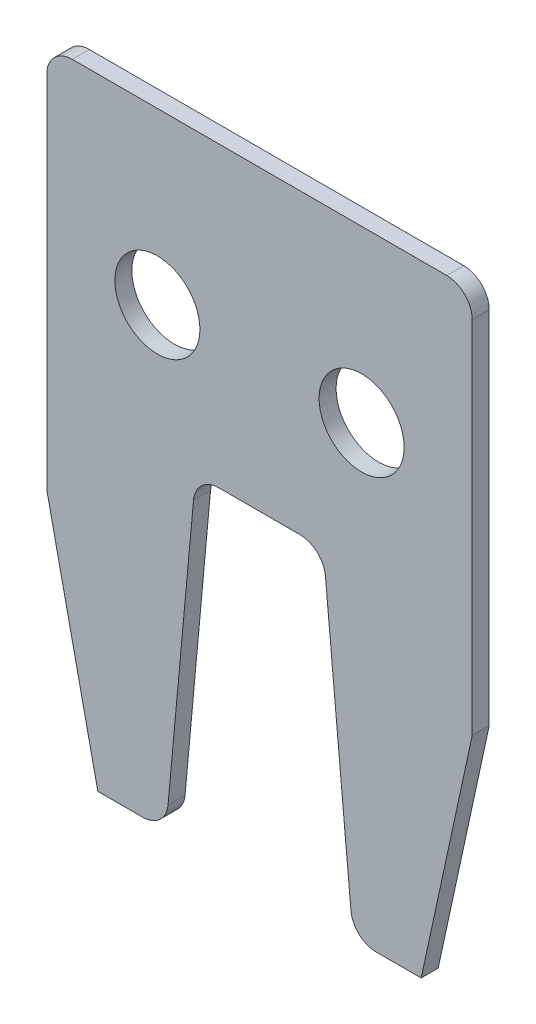
ISO-10303-21;
HEADER;
FILE_DESCRIPTION(('STEP AP214'),'2;1');
FILE_NAME('part.step','',(''),(''),'','','');
FILE_SCHEMA(('AUTOMOTIVE_DESIGN { 1 0 10303 214 1 1 1 1 }'));
ENDSEC;
DATA;
#1=APPLICATION_CONTEXT('core data for automotive mechanical design processes');
#2=APPLICATION_PROTOCOL_DEFINITION('international standard','automotive_design',2000,#1);
#3=PRODUCT_CONTEXT('',#1,'mechanical');
#4=PRODUCT('Part','Part','',(#3));
#5=PRODUCT_RELATED_PRODUCT_CATEGORY('part','',(#4));
#6=PRODUCT_DEFINITION_FORMATION('','',#4);
#7=PRODUCT_DEFINITION_CONTEXT('part definition',#1,'design');
#8=PRODUCT_DEFINITION('design','',#6,#7);
#9=PRODUCT_DEFINITION_SHAPE('','',#8);
#10=(LENGTH_UNIT() NAMED_UNIT(*) SI_UNIT(.MILLI.,.METRE.));
#11=(NAMED_UNIT(*) PLANE_ANGLE_UNIT() SI_UNIT($,.RADIAN.));
#12=(NAMED_UNIT(*) SI_UNIT($,.STERADIAN.) SOLID_ANGLE_UNIT());
#13=UNCERTAINTY_MEASURE_WITH_UNIT(LENGTH_MEASURE(1.E-05),#10,'distance_accuracy_value','');
#14=(GEOMETRIC_REPRESENTATION_CONTEXT(3) GLOBAL_UNCERTAINTY_ASSIGNED_CONTEXT((#13)) GLOBAL_UNIT_ASSIGNED_CONTEXT((#10,
#11,#12)) REPRESENTATION_CONTEXT('',''));
#15=CARTESIAN_POINT('',(0.,0.,0.));
#16=DIRECTION('',(0.,0.,1.));
#17=DIRECTION('',(1.,0.,0.));
#18=AXIS2_PLACEMENT_3D('',#15,#16,#17);
#19=CARTESIAN_POINT('',(-25.,-812.,27.));
#20=DIRECTION('',(0.,1.,0.));
#21=DIRECTION('',(0.,0.,1.));
#22=AXIS2_PLACEMENT_3D('',#19,#20,#21);
#23=PLANE('',#22);
#24=DIRECTION('',(1.,0.,0.));
#25=VECTOR('',#24,1.);
#26=CARTESIAN_POINT('',(-25.,-812.,25.));
#27=LINE('',#26,#25);
#28=CARTESIAN_POINT('',(-19.,-812.,25.));
#29=VERTEX_POINT('',#28);
#30=CARTESIAN_POINT('',(-13.7363824057514,-812.,25.));
#31=VERTEX_POINT('',#30);
#32=EDGE_CURVE('E167',#29,#31,#27,.T.);
#33=ORIENTED_EDGE('',*,*,#32,.T.);
#34=DIRECTION('',(0.,0.,1.));
#35=VECTOR('',#34,1.);
#36=CARTESIAN_POINT('',(-13.7363824057514,-812.,27.));
#37=LINE('',#36,#35);
#38=CARTESIAN_POINT('',(-13.7363824057514,-812.,27.));
#39=VERTEX_POINT('',#38);
#40=EDGE_CURVE('E208',#31,#39,#37,.T.);
#41=ORIENTED_EDGE('',*,*,#40,.T.);
#42=DIRECTION('',(1.,0.,0.));
#43=VECTOR('',#42,1.);
#44=CARTESIAN_POINT('',(-25.,-812.,27.));
#45=LINE('',#44,#43);
#46=CARTESIAN_POINT('',(-19.,-812.,27.));
#47=VERTEX_POINT('',#46);
#48=EDGE_CURVE('E170',#47,#39,#45,.T.);
#49=ORIENTED_EDGE('',*,*,#48,.F.);
#50=DIRECTION('',(0.,0.,1.));
#51=VECTOR('',#50,1.);
#52=CARTESIAN_POINT('',(-19.,-812.,-175.001));
#53=LINE('',#52,#51);
#54=EDGE_CURVE('E157',#29,#47,#53,.T.);
#55=ORIENTED_EDGE('',*,*,#54,.F.);
#56=EDGE_LOOP('',(#33,#41,#49,#55));
#57=FACE_BOUND('',#56,.T.);
#58=ADVANCED_FACE('F38',(#57),#23,.F.);
#59=CARTESIAN_POINT('',(25.,-812.,27.));
#60=DIRECTION('',(-1.,0.,0.));
#61=DIRECTION('',(0.,0.,1.));
#62=AXIS2_PLACEMENT_3D('',#59,#60,#61);
#63=PLANE('',#62);
#64=DIRECTION('',(0.,1.,0.));
#65=VECTOR('',#64,1.);
#66=CARTESIAN_POINT('',(25.,-812.,25.));
#67=LINE('',#66,#65);
#68=CARTESIAN_POINT('',(25.,-784.307405803479,25.));
#69=VERTEX_POINT('',#68);
#70=CARTESIAN_POINT('',(25.,-742.,25.));
#71=VERTEX_POINT('',#70);
#72=EDGE_CURVE('E162',#69,#71,#67,.T.);
#73=ORIENTED_EDGE('',*,*,#72,.T.);
#74=DIRECTION('',(0.,0.,-1.));
#75=VECTOR('',#74,1.);
#76=CARTESIAN_POINT('',(25.,-742.,27.));
#77=LINE('',#76,#75);
#78=CARTESIAN_POINT('',(25.,-742.,27.));
#79=VERTEX_POINT('',#78);
#80=EDGE_CURVE('E224',#71,#79,#77,.F.);
#81=ORIENTED_EDGE('',*,*,#80,.T.);
#82=DIRECTION('',(0.,1.,0.));
#83=VECTOR('',#82,1.);
#84=CARTESIAN_POINT('',(25.,-812.,27.));
#85=LINE('',#84,#83);
#86=CARTESIAN_POINT('',(25.,-784.307405803479,27.));
#87=VERTEX_POINT('',#86);
#88=EDGE_CURVE('E176',#87,#79,#85,.T.);
#89=ORIENTED_EDGE('',*,*,#88,.F.);
#90=DIRECTION('',(0.,0.,1.));
#91=VECTOR('',#90,1.);
#92=CARTESIAN_POINT('',(25.,-784.307405803479,-175.001));
#93=LINE('',#92,#91);
#94=EDGE_CURVE('E274',#69,#87,#93,.T.);
#95=ORIENTED_EDGE('',*,*,#94,.F.);
#96=EDGE_LOOP('',(#73,#81,#89,#95));
#97=FACE_BOUND('',#96,.T.);
#98=ADVANCED_FACE('F314',(#97),#63,.F.);
#99=CARTESIAN_POINT('',(-25.,-739.,27.));
#100=DIRECTION('',(0.,-1.,0.));
#101=DIRECTION('',(0.,0.,-1.));
#102=AXIS2_PLACEMENT_3D('',#99,#100,#101);
#103=PLANE('',#102);
#104=DIRECTION('',(-1.,0.,0.));
#105=VECTOR('',#104,1.);
#106=CARTESIAN_POINT('',(-25.,-739.,27.));
#107=LINE('',#106,#105);
#108=CARTESIAN_POINT('',(22.,-739.,27.));
#109=VERTEX_POINT('',#108);
#110=CARTESIAN_POINT('',(-22.,-739.,27.));
#111=VERTEX_POINT('',#110);
#112=EDGE_CURVE('E180',#109,#111,#107,.T.);
#113=ORIENTED_EDGE('',*,*,#112,.F.);
#114=DIRECTION('',(0.,0.,-1.));
#115=VECTOR('',#114,1.);
#116=CARTESIAN_POINT('',(22.,-739.,27.));
#117=LINE('',#116,#115);
#118=CARTESIAN_POINT('',(22.,-739.,25.));
#119=VERTEX_POINT('',#118);
#120=EDGE_CURVE('E221',#109,#119,#117,.T.);
#121=ORIENTED_EDGE('',*,*,#120,.T.);
#122=DIRECTION('',(-1.,0.,0.));
#123=VECTOR('',#122,1.);
#124=CARTESIAN_POINT('',(-25.,-739.,25.));
#125=LINE('',#124,#123);
#126=CARTESIAN_POINT('',(-22.,-739.,25.));
#127=VERTEX_POINT('',#126);
#128=EDGE_CURVE('E291',#119,#127,#125,.T.);
#129=ORIENTED_EDGE('',*,*,#128,.T.);
#130=DIRECTION('',(0.,0.,-1.));
#131=VECTOR('',#130,1.);
#132=CARTESIAN_POINT('',(-22.,-739.,27.));
#133=LINE('',#132,#131);
#134=EDGE_CURVE('E219',#127,#111,#133,.F.);
#135=ORIENTED_EDGE('',*,*,#134,.T.);
#136=EDGE_LOOP('',(#113,#121,#129,#135));
#137=FACE_BOUND('',#136,.T.);
#138=ADVANCED_FACE('F303',(#137),#103,.F.);
#139=CARTESIAN_POINT('',(-25.,-812.,27.));
#140=DIRECTION('',(1.,0.,0.));
#141=DIRECTION('',(0.,0.,-1.));
#142=AXIS2_PLACEMENT_3D('',#139,#140,#141);
#143=PLANE('',#142);
#144=DIRECTION('',(0.,-1.,0.));
#145=VECTOR('',#144,1.);
#146=CARTESIAN_POINT('',(-25.,-812.,27.));
#147=LINE('',#146,#145);
#148=CARTESIAN_POINT('',(-25.,-742.,27.));
#149=VERTEX_POINT('',#148);
#150=CARTESIAN_POINT('',(-25.,-784.307405803479,27.));
#151=VERTEX_POINT('',#150);
#152=EDGE_CURVE('E286',#149,#151,#147,.T.);
#153=ORIENTED_EDGE('',*,*,#152,.F.);
#154=DIRECTION('',(0.,0.,-1.));
#155=VECTOR('',#154,1.);
#156=CARTESIAN_POINT('',(-25.,-742.,27.));
#157=LINE('',#156,#155);
#158=CARTESIAN_POINT('',(-25.,-742.,25.));
#159=VERTEX_POINT('',#158);
#160=EDGE_CURVE('E226',#149,#159,#157,.T.);
#161=ORIENTED_EDGE('',*,*,#160,.T.);
#162=DIRECTION('',(0.,-1.,0.));
#163=VECTOR('',#162,1.);
#164=CARTESIAN_POINT('',(-25.,-812.,25.));
#165=LINE('',#164,#163);
#166=CARTESIAN_POINT('',(-24.9999999999997,-784.307405803481,25.));
#167=VERTEX_POINT('',#166);
#168=EDGE_CURVE('E182',#159,#167,#165,.T.);
#169=ORIENTED_EDGE('',*,*,#168,.T.);
#170=DIRECTION('',(0.,0.,1.));
#171=VECTOR('',#170,1.);
#172=CARTESIAN_POINT('',(-25.,-784.307405803479,-175.001));
#173=LINE('',#172,#171);
#174=EDGE_CURVE('E160',#167,#151,#173,.T.);
#175=ORIENTED_EDGE('',*,*,#174,.T.);
#176=EDGE_LOOP('',(#153,#161,#169,#175));
#177=FACE_BOUND('',#176,.T.);
#178=ADVANCED_FACE('F298',(#177),#143,.F.);
#179=CARTESIAN_POINT('',(13.7363824057514,-812.,27.));
#180=VERTEX_POINT('',#179);
#181=CARTESIAN_POINT('',(19.,-812.,27.));
#182=VERTEX_POINT('',#181);
#183=EDGE_CURVE('E288',#180,#182,#45,.T.);
#184=ORIENTED_EDGE('',*,*,#183,.F.);
#185=DIRECTION('',(0.,0.,1.));
#186=VECTOR('',#185,1.);
#187=CARTESIAN_POINT('',(13.7363824057514,-812.,27.));
#188=LINE('',#187,#186);
#189=CARTESIAN_POINT('',(13.7363824057514,-812.,25.));
#190=VERTEX_POINT('',#189);
#191=EDGE_CURVE('E199',#180,#190,#188,.F.);
#192=ORIENTED_EDGE('',*,*,#191,.T.);
#193=CARTESIAN_POINT('',(19.,-812.,25.));
#194=VERTEX_POINT('',#193);
#195=EDGE_CURVE('E177',#190,#194,#27,.T.);
#196=ORIENTED_EDGE('',*,*,#195,.T.);
#197=DIRECTION('',(0.,0.,1.));
#198=VECTOR('',#197,1.);
#199=CARTESIAN_POINT('',(19.,-812.,-175.001));
#200=LINE('',#199,#198);
#201=EDGE_CURVE('E273',#194,#182,#200,.T.);
#202=ORIENTED_EDGE('',*,*,#201,.T.);
#203=EDGE_LOOP('',(#184,#192,#196,#202));
#204=FACE_BOUND('',#203,.T.);
#205=ADVANCED_FACE('F321',(#204),#23,.F.);
#206=CARTESIAN_POINT('',(0.,0.,27.));
#207=DIRECTION('',(0.,0.,-1.));
#208=DIRECTION('',(-1.,0.,0.));
#209=AXIS2_PLACEMENT_3D('',#206,#207,#208);
#210=PLANE('',#209);
#211=CARTESIAN_POINT('',(12.,-759.,27.));
#212=DIRECTION('',(0.,0.,1.));
#213=DIRECTION('',(-1.,0.,0.));
#214=AXIS2_PLACEMENT_3D('',#211,#212,#213);
#215=CIRCLE('',#214,5.);
#216=CARTESIAN_POINT('',(7.,-759.,27.));
#217=VERTEX_POINT('',#216);
#218=EDGE_CURVE('E282',#217,#217,#215,.T.);
#219=ORIENTED_EDGE('',*,*,#218,.F.);
#220=EDGE_LOOP('',(#219));
#221=FACE_BOUND('',#220,.T.);
#222=CARTESIAN_POINT('',(-12.,-759.,27.));
#223=DIRECTION('',(0.,0.,1.));
#224=DIRECTION('',(1.,0.,0.));
#225=AXIS2_PLACEMENT_3D('',#222,#223,#224);
#226=CIRCLE('',#225,5.);
#227=CARTESIAN_POINT('',(-7.,-759.,27.));
#228=VERTEX_POINT('',#227);
#229=EDGE_CURVE('E270',#228,#228,#226,.T.);
#230=ORIENTED_EDGE('',*,*,#229,.F.);
#231=EDGE_LOOP('',(#230));
#232=FACE_BOUND('',#231,.T.);
#233=DIRECTION('',(-0.0917170494912585,0.995785108762236,0.));
#234=VECTOR('',#233,1.);
#235=CARTESIAN_POINT('',(11.,-812.,27.));
#236=LINE('',#235,#234);
#237=CARTESIAN_POINT('',(10.7490270794647,-809.275151148474,27.));
#238=VERTEX_POINT('',#237);
#239=CARTESIAN_POINT('',(7.75097292053531,-776.724848851526,27.));
#240=VERTEX_POINT('',#239);
#241=EDGE_CURVE('E248',#238,#240,#236,.T.);
#242=ORIENTED_EDGE('',*,*,#241,.F.);
#243=CARTESIAN_POINT('',(13.7363824057514,-809.,27.));
#244=DIRECTION('',(0.,0.,-1.));
#245=DIRECTION('',(-1.,0.,0.));
#246=AXIS2_PLACEMENT_3D('',#243,#244,#245);
#247=CIRCLE('',#246,3.);
#248=EDGE_CURVE('E197',#238,#180,#247,.F.);
#249=ORIENTED_EDGE('',*,*,#248,.T.);
#250=ORIENTED_EDGE('',*,*,#183,.T.);
#251=DIRECTION('',(-0.211751254463143,-0.977323593408696,0.));
#252=VECTOR('',#251,1.);
#253=CARTESIAN_POINT('',(25.,-784.307405803479,27.));
#254=LINE('',#253,#252);
#255=EDGE_CURVE('E269',#87,#182,#254,.T.);
#256=ORIENTED_EDGE('',*,*,#255,.F.);
#257=ORIENTED_EDGE('',*,*,#88,.T.);
#258=CARTESIAN_POINT('',(22.,-742.,27.));
#259=DIRECTION('',(0.,0.,-1.));
#260=DIRECTION('',(-1.,0.,0.));
#261=AXIS2_PLACEMENT_3D('',#258,#259,#260);
#262=CIRCLE('',#261,3.);
#263=EDGE_CURVE('E193',#79,#109,#262,.F.);
#264=ORIENTED_EDGE('',*,*,#263,.T.);
#265=ORIENTED_EDGE('',*,*,#112,.T.);
#266=CARTESIAN_POINT('',(-22.,-742.,27.));
#267=DIRECTION('',(0.,0.,-1.));
#268=DIRECTION('',(-1.,0.,0.));
#269=AXIS2_PLACEMENT_3D('',#266,#267,#268);
#270=CIRCLE('',#269,3.);
#271=EDGE_CURVE('E191',#111,#149,#270,.F.);
#272=ORIENTED_EDGE('',*,*,#271,.T.);
#273=ORIENTED_EDGE('',*,*,#152,.T.);
#274=DIRECTION('',(-0.211751254463143,0.977323593408696,0.));
#275=VECTOR('',#274,1.);
#276=CARTESIAN_POINT('',(-25.,-784.307405803479,27.));
#277=LINE('',#276,#275);
#278=EDGE_CURVE('E171',#47,#151,#277,.T.);
#279=ORIENTED_EDGE('',*,*,#278,.F.);
#280=ORIENTED_EDGE('',*,*,#48,.T.);
#281=CARTESIAN_POINT('',(-13.7363824057514,-809.,27.));
#282=DIRECTION('',(0.,0.,-1.));
#283=DIRECTION('',(-1.,0.,0.));
#284=AXIS2_PLACEMENT_3D('',#281,#282,#283);
#285=CIRCLE('',#284,3.);
#286=CARTESIAN_POINT('',(-10.7490270794647,-809.275151148474,27.));
#287=VERTEX_POINT('',#286);
#288=EDGE_CURVE('E195',#39,#287,#285,.F.);
#289=ORIENTED_EDGE('',*,*,#288,.T.);
#290=DIRECTION('',(-0.0917170494912585,-0.995785108762236,0.));
#291=VECTOR('',#290,1.);
#292=CARTESIAN_POINT('',(-11.,-812.,27.));
#293=LINE('',#292,#291);
#294=CARTESIAN_POINT('',(-7.75097292053531,-776.724848851526,27.));
#295=VERTEX_POINT('',#294);
#296=EDGE_CURVE('E239',#295,#287,#293,.T.);
#297=ORIENTED_EDGE('',*,*,#296,.F.);
#298=CARTESIAN_POINT('',(-4.7636175942486,-777.,27.));
#299=DIRECTION('',(0.,0.,-1.));
#300=DIRECTION('',(-1.,0.,0.));
#301=AXIS2_PLACEMENT_3D('',#298,#299,#300);
#302=CIRCLE('',#301,3.);
#303=CARTESIAN_POINT('',(-4.7636175942486,-774.,27.));
#304=VERTEX_POINT('',#303);
#305=EDGE_CURVE('E46',#295,#304,#302,.T.);
#306=ORIENTED_EDGE('',*,*,#305,.T.);
#307=DIRECTION('',(-1.,0.,0.));
#308=VECTOR('',#307,1.);
#309=CARTESIAN_POINT('',(7.5,-774.,27.));
#310=LINE('',#309,#308);
#311=CARTESIAN_POINT('',(4.7636175942486,-774.,27.));
#312=VERTEX_POINT('',#311);
#313=EDGE_CURVE('E238',#312,#304,#310,.T.);
#314=ORIENTED_EDGE('',*,*,#313,.F.);
#315=CARTESIAN_POINT('',(4.7636175942486,-777.,27.));
#316=DIRECTION('',(0.,0.,-1.));
#317=DIRECTION('',(-1.,0.,0.));
#318=AXIS2_PLACEMENT_3D('',#315,#316,#317);
#319=CIRCLE('',#318,3.);
#320=EDGE_CURVE('E229',#312,#240,#319,.T.);
#321=ORIENTED_EDGE('',*,*,#320,.T.);
#322=EDGE_LOOP('',(#242,#249,#250,#256,#257,#264,#265,#272,#273,#279,#280,#289,#297,#306,#314,#321));
#323=FACE_BOUND('',#322,.T.);
#324=ADVANCED_FACE('F237',(#221,#232,#323),#210,.F.);
#325=CARTESIAN_POINT('',(0.,0.,25.));
#326=DIRECTION('',(0.,0.,-1.));
#327=DIRECTION('',(-1.,0.,0.));
#328=AXIS2_PLACEMENT_3D('',#325,#326,#327);
#329=PLANE('',#328);
#330=ORIENTED_EDGE('',*,*,#195,.F.);
#331=CARTESIAN_POINT('',(13.7363824057514,-809.,25.));
#332=DIRECTION('',(0.,0.,-1.));
#333=DIRECTION('',(-1.,0.,0.));
#334=AXIS2_PLACEMENT_3D('',#331,#332,#333);
#335=CIRCLE('',#334,3.);
#336=CARTESIAN_POINT('',(10.7490270794647,-809.275151148474,25.));
#337=VERTEX_POINT('',#336);
#338=EDGE_CURVE('E206',#190,#337,#335,.T.);
#339=ORIENTED_EDGE('',*,*,#338,.T.);
#340=DIRECTION('',(-0.0917170494912585,0.995785108762236,0.));
#341=VECTOR('',#340,1.);
#342=CARTESIAN_POINT('',(11.,-812.,25.));
#343=LINE('',#342,#341);
#344=CARTESIAN_POINT('',(7.75097292053531,-776.724848851526,25.));
#345=VERTEX_POINT('',#344);
#346=EDGE_CURVE('E262',#337,#345,#343,.T.);
#347=ORIENTED_EDGE('',*,*,#346,.T.);
#348=CARTESIAN_POINT('',(4.7636175942486,-777.,25.));
#349=DIRECTION('',(0.,0.,-1.));
#350=DIRECTION('',(-1.,0.,0.));
#351=AXIS2_PLACEMENT_3D('',#348,#349,#350);
#352=CIRCLE('',#351,3.);
#353=CARTESIAN_POINT('',(4.7636175942486,-774.,25.));
#354=VERTEX_POINT('',#353);
#355=EDGE_CURVE('E231',#345,#354,#352,.F.);
#356=ORIENTED_EDGE('',*,*,#355,.T.);
#357=DIRECTION('',(-1.,0.,0.));
#358=VECTOR('',#357,1.);
#359=CARTESIAN_POINT('',(7.5,-774.,25.));
#360=LINE('',#359,#358);
#361=CARTESIAN_POINT('',(-4.7636175942486,-774.,25.));
#362=VERTEX_POINT('',#361);
#363=EDGE_CURVE('E253',#354,#362,#360,.T.);
#364=ORIENTED_EDGE('',*,*,#363,.T.);
#365=CARTESIAN_POINT('',(-4.7636175942486,-777.,25.));
#366=DIRECTION('',(0.,0.,-1.));
#367=DIRECTION('',(-1.,0.,0.));
#368=AXIS2_PLACEMENT_3D('',#365,#366,#367);
#369=CIRCLE('',#368,3.);
#370=CARTESIAN_POINT('',(-7.75097292053531,-776.724848851526,25.));
#371=VERTEX_POINT('',#370);
#372=EDGE_CURVE('E11',#362,#371,#369,.F.);
#373=ORIENTED_EDGE('',*,*,#372,.T.);
#374=DIRECTION('',(-0.0917170494912585,-0.995785108762236,0.));
#375=VECTOR('',#374,1.);
#376=CARTESIAN_POINT('',(-11.,-812.,25.));
#377=LINE('',#376,#375);
#378=CARTESIAN_POINT('',(-10.7490270794647,-809.275151148474,25.));
#379=VERTEX_POINT('',#378);
#380=EDGE_CURVE('E252',#371,#379,#377,.T.);
#381=ORIENTED_EDGE('',*,*,#380,.T.);
#382=CARTESIAN_POINT('',(-13.7363824057514,-809.,25.));
#383=DIRECTION('',(0.,0.,-1.));
#384=DIRECTION('',(-1.,0.,0.));
#385=AXIS2_PLACEMENT_3D('',#382,#383,#384);
#386=CIRCLE('',#385,3.);
#387=EDGE_CURVE('E53',#379,#31,#386,.T.);
#388=ORIENTED_EDGE('',*,*,#387,.T.);
#389=ORIENTED_EDGE('',*,*,#32,.F.);
#390=DIRECTION('',(-0.211751254463143,0.977323593408696,0.));
#391=VECTOR('',#390,1.);
#392=CARTESIAN_POINT('',(-25.,-784.307405803479,25.));
#393=LINE('',#392,#391);
#394=EDGE_CURVE('E153',#29,#167,#393,.T.);
#395=ORIENTED_EDGE('',*,*,#394,.T.);
#396=ORIENTED_EDGE('',*,*,#168,.F.);
#397=CARTESIAN_POINT('',(-22.,-742.,25.));
#398=DIRECTION('',(0.,0.,-1.));
#399=DIRECTION('',(-1.,0.,0.));
#400=AXIS2_PLACEMENT_3D('',#397,#398,#399);
#401=CIRCLE('',#400,3.);
#402=EDGE_CURVE('E201',#159,#127,#401,.T.);
#403=ORIENTED_EDGE('',*,*,#402,.T.);
#404=ORIENTED_EDGE('',*,*,#128,.F.);
#405=CARTESIAN_POINT('',(22.,-742.,25.));
#406=DIRECTION('',(0.,0.,-1.));
#407=DIRECTION('',(-1.,0.,0.));
#408=AXIS2_PLACEMENT_3D('',#405,#406,#407);
#409=CIRCLE('',#408,3.);
#410=EDGE_CURVE('E203',#119,#71,#409,.T.);
#411=ORIENTED_EDGE('',*,*,#410,.T.);
#412=ORIENTED_EDGE('',*,*,#72,.F.);
#413=DIRECTION('',(-0.211751254463143,-0.977323593408696,0.));
#414=VECTOR('',#413,1.);
#415=CARTESIAN_POINT('',(25.,-784.307405803479,25.));
#416=LINE('',#415,#414);
#417=EDGE_CURVE('E266',#69,#194,#416,.T.);
#418=ORIENTED_EDGE('',*,*,#417,.T.);
#419=EDGE_LOOP('',(#330,#339,#347,#356,#364,#373,#381,#388,#389,#395,#396,#403,#404,#411,#412,#418));
#420=FACE_BOUND('',#419,.T.);
#421=CARTESIAN_POINT('',(12.,-759.,25.));
#422=DIRECTION('',(0.,0.,-1.));
#423=DIRECTION('',(-1.,0.,0.));
#424=AXIS2_PLACEMENT_3D('',#421,#422,#423);
#425=CIRCLE('',#424,5.);
#426=CARTESIAN_POINT('',(7.,-759.,25.));
#427=VERTEX_POINT('',#426);
#428=EDGE_CURVE('E265',#427,#427,#425,.F.);
#429=ORIENTED_EDGE('',*,*,#428,.T.);
#430=EDGE_LOOP('',(#429));
#431=FACE_BOUND('',#430,.T.);
#432=CARTESIAN_POINT('',(-12.,-759.,25.));
#433=DIRECTION('',(0.,0.,-1.));
#434=DIRECTION('',(-1.,0.,0.));
#435=AXIS2_PLACEMENT_3D('',#432,#433,#434);
#436=CIRCLE('',#435,5.);
#437=CARTESIAN_POINT('',(-17.,-759.,25.));
#438=VERTEX_POINT('',#437);
#439=EDGE_CURVE('E280',#438,#438,#436,.F.);
#440=ORIENTED_EDGE('',*,*,#439,.T.);
#441=EDGE_LOOP('',(#440));
#442=FACE_BOUND('',#441,.T.);
#443=ADVANCED_FACE('F174',(#420,#431,#442),#329,.T.);
#444=CARTESIAN_POINT('',(25.,-784.307405803479,-175.001));
#445=DIRECTION('',(-0.977323593408696,0.211751254463143,0.));
#446=DIRECTION('',(-0.211751254463143,-0.977323593408696,0.));
#447=AXIS2_PLACEMENT_3D('',#444,#445,#446);
#448=PLANE('',#447);
#449=ORIENTED_EDGE('',*,*,#94,.T.);
#450=ORIENTED_EDGE('',*,*,#255,.T.);
#451=ORIENTED_EDGE('',*,*,#201,.F.);
#452=ORIENTED_EDGE('',*,*,#417,.F.);
#453=EDGE_LOOP('',(#449,#450,#451,#452));
#454=FACE_BOUND('',#453,.T.);
#455=ADVANCED_FACE('F316',(#454),#448,.F.);
#456=CARTESIAN_POINT('',(-12.,-759.,-175.001));
#457=DIRECTION('',(0.,0.,1.));
#458=DIRECTION('',(1.,0.,0.));
#459=AXIS2_PLACEMENT_3D('',#456,#457,#458);
#460=CYLINDRICAL_SURFACE('',#459,5.);
#461=ORIENTED_EDGE('',*,*,#439,.F.);
#462=EDGE_LOOP('',(#461));
#463=FACE_BOUND('',#462,.T.);
#464=ORIENTED_EDGE('',*,*,#229,.T.);
#465=EDGE_LOOP('',(#464));
#466=FACE_BOUND('',#465,.T.);
#467=ADVANCED_FACE('F376',(#463,#466),#460,.F.);
#468=CARTESIAN_POINT('',(12.,-759.,-175.001));
#469=DIRECTION('',(0.,0.,1.));
#470=DIRECTION('',(1.,0.,0.));
#471=AXIS2_PLACEMENT_3D('',#468,#469,#470);
#472=CYLINDRICAL_SURFACE('',#471,5.);
#473=ORIENTED_EDGE('',*,*,#428,.F.);
#474=EDGE_LOOP('',(#473));
#475=FACE_BOUND('',#474,.T.);
#476=ORIENTED_EDGE('',*,*,#218,.T.);
#477=EDGE_LOOP('',(#476));
#478=FACE_BOUND('',#477,.T.);
#479=ADVANCED_FACE('F373',(#475,#478),#472,.F.);
#480=CARTESIAN_POINT('',(-11.,-812.,-175.001));
#481=DIRECTION('',(-0.995785108762236,0.0917170494912585,0.));
#482=DIRECTION('',(-0.0917170494912585,-0.995785108762236,0.));
#483=AXIS2_PLACEMENT_3D('',#480,#481,#482);
#484=PLANE('',#483);
#485=ORIENTED_EDGE('',*,*,#296,.T.);
#486=DIRECTION('',(0.,0.,1.));
#487=VECTOR('',#486,1.);
#488=CARTESIAN_POINT('',(-10.7490270794647,-809.275151148474,-175.001));
#489=LINE('',#488,#487);
#490=EDGE_CURVE('E61',#287,#379,#489,.F.);
#491=ORIENTED_EDGE('',*,*,#490,.T.);
#492=ORIENTED_EDGE('',*,*,#380,.F.);
#493=DIRECTION('',(0.,0.,1.));
#494=VECTOR('',#493,1.);
#495=CARTESIAN_POINT('',(-7.75097292053531,-776.724848851526,27.));
#496=LINE('',#495,#494);
#497=EDGE_CURVE('E210',#371,#295,#496,.T.);
#498=ORIENTED_EDGE('',*,*,#497,.T.);
#499=EDGE_LOOP('',(#485,#491,#492,#498));
#500=FACE_BOUND('',#499,.T.);
#501=ADVANCED_FACE('F254',(#500),#484,.F.);
#502=CARTESIAN_POINT('',(7.5,-774.,-175.001));
#503=DIRECTION('',(0.,1.,0.));
#504=DIRECTION('',(0.,0.,1.));
#505=AXIS2_PLACEMENT_3D('',#502,#503,#504);
#506=PLANE('',#505);
#507=ORIENTED_EDGE('',*,*,#363,.F.);
#508=DIRECTION('',(0.,0.,1.));
#509=VECTOR('',#508,1.);
#510=CARTESIAN_POINT('',(4.7636175942486,-774.,27.));
#511=LINE('',#510,#509);
#512=EDGE_CURVE('E216',#354,#312,#511,.T.);
#513=ORIENTED_EDGE('',*,*,#512,.T.);
#514=ORIENTED_EDGE('',*,*,#313,.T.);
#515=DIRECTION('',(0.,0.,1.));
#516=VECTOR('',#515,1.);
#517=CARTESIAN_POINT('',(-4.7636175942486,-774.,25.));
#518=LINE('',#517,#516);
#519=EDGE_CURVE('E214',#304,#362,#518,.F.);
#520=ORIENTED_EDGE('',*,*,#519,.T.);
#521=EDGE_LOOP('',(#507,#513,#514,#520));
#522=FACE_BOUND('',#521,.T.);
#523=ADVANCED_FACE('F245',(#522),#506,.F.);
#524=CARTESIAN_POINT('',(11.,-812.,-175.001));
#525=DIRECTION('',(0.995785108762236,0.0917170494912585,0.));
#526=DIRECTION('',(-0.0917170494912585,0.995785108762236,0.));
#527=AXIS2_PLACEMENT_3D('',#524,#525,#526);
#528=PLANE('',#527);
#529=ORIENTED_EDGE('',*,*,#346,.F.);
#530=DIRECTION('',(0.,0.,1.));
#531=VECTOR('',#530,1.);
#532=CARTESIAN_POINT('',(10.7490270794647,-809.275151148474,-175.001));
#533=LINE('',#532,#531);
#534=EDGE_CURVE('E188',#337,#238,#533,.T.);
#535=ORIENTED_EDGE('',*,*,#534,.T.);
#536=ORIENTED_EDGE('',*,*,#241,.T.);
#537=DIRECTION('',(0.,0.,1.));
#538=VECTOR('',#537,1.);
#539=CARTESIAN_POINT('',(7.75097292053531,-776.724848851526,25.));
#540=LINE('',#539,#538);
#541=EDGE_CURVE('E186',#240,#345,#540,.F.);
#542=ORIENTED_EDGE('',*,*,#541,.T.);
#543=EDGE_LOOP('',(#529,#535,#536,#542));
#544=FACE_BOUND('',#543,.T.);
#545=ADVANCED_FACE('F329',(#544),#528,.F.);
#546=CARTESIAN_POINT('',(-25.,-784.307405803479,-175.001));
#547=DIRECTION('',(0.977323593408696,0.211751254463143,0.));
#548=DIRECTION('',(-0.211751254463143,0.977323593408696,0.));
#549=AXIS2_PLACEMENT_3D('',#546,#547,#548);
#550=PLANE('',#549);
#551=ORIENTED_EDGE('',*,*,#54,.T.);
#552=ORIENTED_EDGE('',*,*,#278,.T.);
#553=ORIENTED_EDGE('',*,*,#174,.F.);
#554=ORIENTED_EDGE('',*,*,#394,.F.);
#555=EDGE_LOOP('',(#551,#552,#553,#554));
#556=FACE_BOUND('',#555,.T.);
#557=ADVANCED_FACE('F155',(#556),#550,.F.);
#558=CARTESIAN_POINT('',(13.7363824057514,-809.,-175.001));
#559=DIRECTION('',(0.,0.,1.));
#560=DIRECTION('',(1.,0.,0.));
#561=AXIS2_PLACEMENT_3D('',#558,#559,#560);
#562=CYLINDRICAL_SURFACE('',#561,3.);
#563=ORIENTED_EDGE('',*,*,#338,.F.);
#564=ORIENTED_EDGE('',*,*,#191,.F.);
#565=ORIENTED_EDGE('',*,*,#248,.F.);
#566=ORIENTED_EDGE('',*,*,#534,.F.);
#567=EDGE_LOOP('',(#563,#564,#565,#566));
#568=FACE_BOUND('',#567,.T.);
#569=ADVANCED_FACE('F324',(#568),#562,.T.);
#570=CARTESIAN_POINT('',(-13.7363824057514,-809.,27.));
#571=DIRECTION('',(0.,0.,1.));
#572=DIRECTION('',(1.,0.,0.));
#573=AXIS2_PLACEMENT_3D('',#570,#571,#572);
#574=CYLINDRICAL_SURFACE('',#573,3.);
#575=ORIENTED_EDGE('',*,*,#387,.F.);
#576=ORIENTED_EDGE('',*,*,#490,.F.);
#577=ORIENTED_EDGE('',*,*,#288,.F.);
#578=ORIENTED_EDGE('',*,*,#40,.F.);
#579=EDGE_LOOP('',(#575,#576,#577,#578));
#580=FACE_BOUND('',#579,.T.);
#581=ADVANCED_FACE('F334',(#580),#574,.T.);
#582=CARTESIAN_POINT('',(4.7636175942486,-777.,-175.001));
#583=DIRECTION('',(0.,0.,-1.));
#584=DIRECTION('',(-1.,0.,0.));
#585=AXIS2_PLACEMENT_3D('',#582,#583,#584);
#586=CYLINDRICAL_SURFACE('',#585,3.);
#587=ORIENTED_EDGE('',*,*,#355,.F.);
#588=ORIENTED_EDGE('',*,*,#541,.F.);
#589=ORIENTED_EDGE('',*,*,#320,.F.);
#590=ORIENTED_EDGE('',*,*,#512,.F.);
#591=EDGE_LOOP('',(#587,#588,#589,#590));
#592=FACE_BOUND('',#591,.T.);
#593=ADVANCED_FACE('F332',(#592),#586,.F.);
#594=CARTESIAN_POINT('',(-4.7636175942486,-777.,-175.001));
#595=DIRECTION('',(0.,0.,-1.));
#596=DIRECTION('',(-1.,0.,0.));
#597=AXIS2_PLACEMENT_3D('',#594,#595,#596);
#598=CYLINDRICAL_SURFACE('',#597,3.);
#599=ORIENTED_EDGE('',*,*,#372,.F.);
#600=ORIENTED_EDGE('',*,*,#519,.F.);
#601=ORIENTED_EDGE('',*,*,#305,.F.);
#602=ORIENTED_EDGE('',*,*,#497,.F.);
#603=EDGE_LOOP('',(#599,#600,#601,#602));
#604=FACE_BOUND('',#603,.T.);
#605=ADVANCED_FACE('F251',(#604),#598,.F.);
#606=CARTESIAN_POINT('',(22.,-742.,27.));
#607=DIRECTION('',(0.,0.,-1.));
#608=DIRECTION('',(-1.,0.,0.));
#609=AXIS2_PLACEMENT_3D('',#606,#607,#608);
#610=CYLINDRICAL_SURFACE('',#609,3.);
#611=ORIENTED_EDGE('',*,*,#263,.F.);
#612=ORIENTED_EDGE('',*,*,#80,.F.);
#613=ORIENTED_EDGE('',*,*,#410,.F.);
#614=ORIENTED_EDGE('',*,*,#120,.F.);
#615=EDGE_LOOP('',(#611,#612,#613,#614));
#616=FACE_BOUND('',#615,.T.);
#617=ADVANCED_FACE('F310',(#616),#610,.T.);
#618=CARTESIAN_POINT('',(-22.,-742.,27.));
#619=DIRECTION('',(0.,0.,-1.));
#620=DIRECTION('',(-1.,0.,0.));
#621=AXIS2_PLACEMENT_3D('',#618,#619,#620);
#622=CYLINDRICAL_SURFACE('',#621,3.);
#623=ORIENTED_EDGE('',*,*,#271,.F.);
#624=ORIENTED_EDGE('',*,*,#134,.F.);
#625=ORIENTED_EDGE('',*,*,#402,.F.);
#626=ORIENTED_EDGE('',*,*,#160,.F.);
#627=EDGE_LOOP('',(#623,#624,#625,#626));
#628=FACE_BOUND('',#627,.T.);
#629=ADVANCED_FACE('F40',(#628),#622,.T.);
#630=CLOSED_SHELL('',(#58,#98,#138,#178,#205,#324,#443,#455,#467,#479,#501,#523,#545,#557,#569,
#581,#593,#605,#617,#629));
#631=MANIFOLD_SOLID_BREP('B2',#630);
#632=ADVANCED_BREP_SHAPE_REPRESENTATION('',(#18,#631),#14);
#633=SHAPE_DEFINITION_REPRESENTATION(#9,#632);
ENDSEC;
END-ISO-10303-21;
